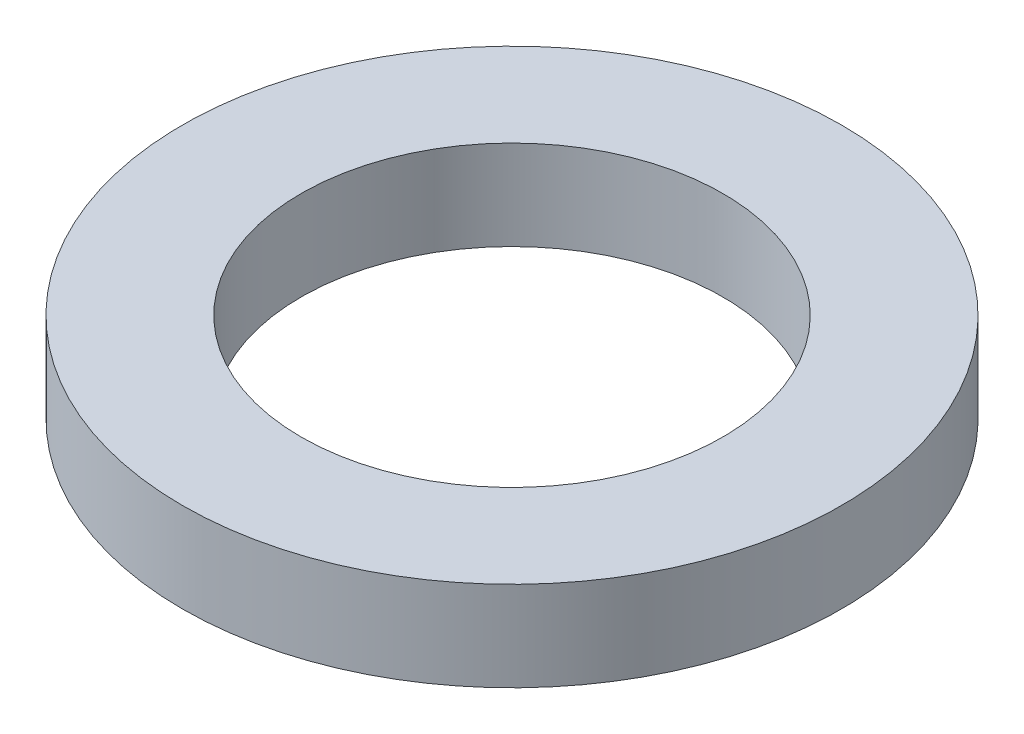
ISO-10303-21;
HEADER;
FILE_DESCRIPTION(('STEP AP214'),'2;1');
FILE_NAME('part.step','',(''),(''),'','','');
FILE_SCHEMA(('AUTOMOTIVE_DESIGN { 1 0 10303 214 1 1 1 1 }'));
ENDSEC;
DATA;
#1=APPLICATION_CONTEXT('core data for automotive mechanical design processes');
#2=APPLICATION_PROTOCOL_DEFINITION('international standard','automotive_design',2000,#1);
#3=PRODUCT_CONTEXT('',#1,'mechanical');
#4=PRODUCT('Part','Part','',(#3));
#5=PRODUCT_RELATED_PRODUCT_CATEGORY('part','',(#4));
#6=PRODUCT_DEFINITION_FORMATION('','',#4);
#7=PRODUCT_DEFINITION_CONTEXT('part definition',#1,'design');
#8=PRODUCT_DEFINITION('design','',#6,#7);
#9=PRODUCT_DEFINITION_SHAPE('','',#8);
#10=(LENGTH_UNIT() NAMED_UNIT(*) SI_UNIT(.MILLI.,.METRE.));
#11=(NAMED_UNIT(*) PLANE_ANGLE_UNIT() SI_UNIT($,.RADIAN.));
#12=(NAMED_UNIT(*) SI_UNIT($,.STERADIAN.) SOLID_ANGLE_UNIT());
#13=UNCERTAINTY_MEASURE_WITH_UNIT(LENGTH_MEASURE(1.E-05),#10,'distance_accuracy_value','');
#14=(GEOMETRIC_REPRESENTATION_CONTEXT(3) GLOBAL_UNCERTAINTY_ASSIGNED_CONTEXT((#13)) GLOBAL_UNIT_ASSIGNED_CONTEXT((#10,
#11,#12)) REPRESENTATION_CONTEXT('',''));
#15=CARTESIAN_POINT('',(0.,0.,0.));
#16=DIRECTION('',(0.,0.,1.));
#17=DIRECTION('',(1.,0.,0.));
#18=AXIS2_PLACEMENT_3D('',#15,#16,#17);
#19=CARTESIAN_POINT('',(0.,17.,0.));
#20=DIRECTION('',(0.,-1.,0.));
#21=DIRECTION('',(0.,0.,-1.));
#22=AXIS2_PLACEMENT_3D('',#19,#20,#21);
#23=CYLINDRICAL_SURFACE('',#22,62.5);
#24=CARTESIAN_POINT('',(0.,17.,0.));
#25=DIRECTION('',(0.,1.,0.));
#26=DIRECTION('',(0.,0.,1.));
#27=AXIS2_PLACEMENT_3D('',#24,#25,#26);
#28=CIRCLE('',#27,62.5);
#29=CARTESIAN_POINT('',(0.,17.,62.5));
#30=VERTEX_POINT('',#29);
#31=EDGE_CURVE('E10',#30,#30,#28,.T.);
#32=ORIENTED_EDGE('',*,*,#31,.F.);
#33=EDGE_LOOP('',(#32));
#34=FACE_BOUND('',#33,.T.);
#35=CARTESIAN_POINT('',(0.,0.,0.));
#36=DIRECTION('',(0.,1.,0.));
#37=DIRECTION('',(0.,0.,1.));
#38=AXIS2_PLACEMENT_3D('',#35,#36,#37);
#39=CIRCLE('',#38,62.5);
#40=CARTESIAN_POINT('',(0.,0.,62.5));
#41=VERTEX_POINT('',#40);
#42=EDGE_CURVE('E37',#41,#41,#39,.T.);
#43=ORIENTED_EDGE('',*,*,#42,.T.);
#44=EDGE_LOOP('',(#43));
#45=FACE_BOUND('',#44,.T.);
#46=ADVANCED_FACE('F40',(#34,#45),#23,.T.);
#47=CARTESIAN_POINT('',(0.,17.,0.));
#48=DIRECTION('',(0.,1.,0.));
#49=DIRECTION('',(0.,0.,1.));
#50=AXIS2_PLACEMENT_3D('',#47,#48,#49);
#51=PLANE('',#50);
#52=CARTESIAN_POINT('',(0.,17.,0.));
#53=DIRECTION('',(0.,1.,0.));
#54=DIRECTION('',(0.,0.,1.));
#55=AXIS2_PLACEMENT_3D('',#52,#53,#54);
#56=CIRCLE('',#55,40.);
#57=CARTESIAN_POINT('',(0.,17.,40.));
#58=VERTEX_POINT('',#57);
#59=EDGE_CURVE('E50',#58,#58,#56,.T.);
#60=ORIENTED_EDGE('',*,*,#59,.F.);
#61=EDGE_LOOP('',(#60));
#62=FACE_BOUND('',#61,.T.);
#63=ORIENTED_EDGE('',*,*,#31,.T.);
#64=EDGE_LOOP('',(#63));
#65=FACE_BOUND('',#64,.T.);
#66=ADVANCED_FACE('F59',(#62,#65),#51,.T.);
#67=CARTESIAN_POINT('',(0.,0.,0.));
#68=DIRECTION('',(0.,1.,0.));
#69=DIRECTION('',(0.,0.,1.));
#70=AXIS2_PLACEMENT_3D('',#67,#68,#69);
#71=PLANE('',#70);
#72=CARTESIAN_POINT('',(0.,0.,0.));
#73=DIRECTION('',(0.,1.,0.));
#74=DIRECTION('',(0.,0.,1.));
#75=AXIS2_PLACEMENT_3D('',#72,#73,#74);
#76=CIRCLE('',#75,40.);
#77=CARTESIAN_POINT('',(0.,0.,40.));
#78=VERTEX_POINT('',#77);
#79=EDGE_CURVE('E47',#78,#78,#76,.T.);
#80=ORIENTED_EDGE('',*,*,#79,.T.);
#81=EDGE_LOOP('',(#80));
#82=FACE_BOUND('',#81,.T.);
#83=ORIENTED_EDGE('',*,*,#42,.F.);
#84=EDGE_LOOP('',(#83));
#85=FACE_BOUND('',#84,.T.);
#86=ADVANCED_FACE('F58',(#82,#85),#71,.F.);
#87=CARTESIAN_POINT('',(0.,17.,0.));
#88=DIRECTION('',(0.,-1.,0.));
#89=DIRECTION('',(0.,0.,-1.));
#90=AXIS2_PLACEMENT_3D('',#87,#88,#89);
#91=CYLINDRICAL_SURFACE('',#90,40.);
#92=ORIENTED_EDGE('',*,*,#59,.T.);
#93=EDGE_LOOP('',(#92));
#94=FACE_BOUND('',#93,.T.);
#95=ORIENTED_EDGE('',*,*,#79,.F.);
#96=EDGE_LOOP('',(#95));
#97=FACE_BOUND('',#96,.T.);
#98=ADVANCED_FACE('F54',(#94,#97),#91,.F.);
#99=CLOSED_SHELL('',(#46,#66,#86,#98));
#100=MANIFOLD_SOLID_BREP('B2',#99);
#101=ADVANCED_BREP_SHAPE_REPRESENTATION('',(#18,#100),#14);
#102=SHAPE_DEFINITION_REPRESENTATION(#9,#101);
ENDSEC;
END-ISO-10303-21;
